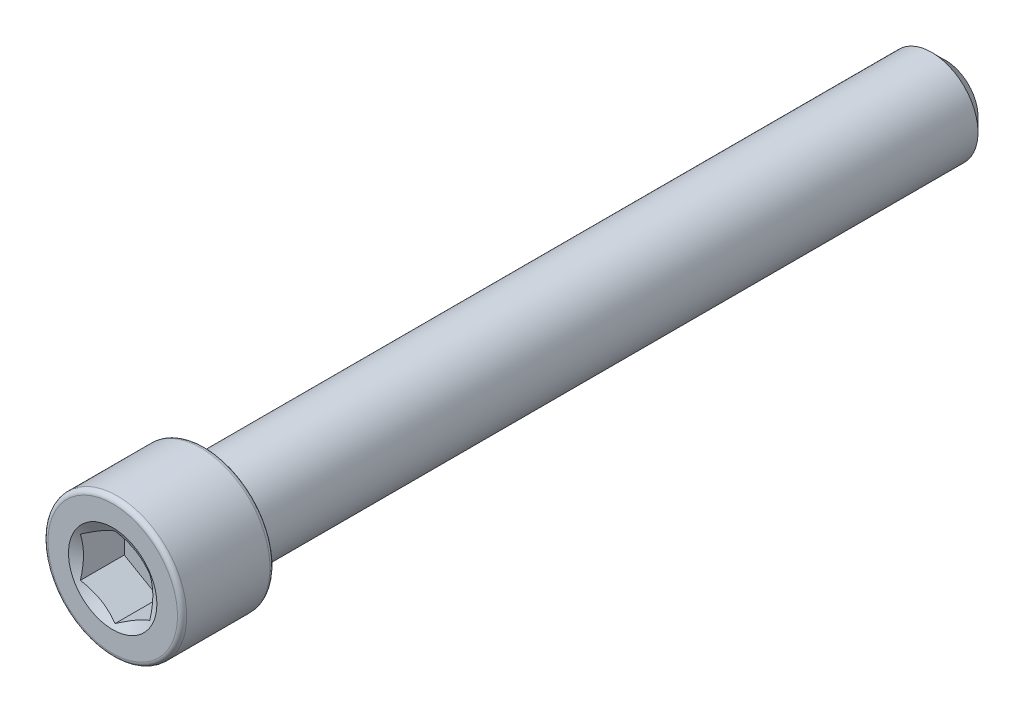
ISO-10303-21;
HEADER;
FILE_DESCRIPTION(('STEP AP214'),'2;1');
FILE_NAME('part.step','',(''),(''),'','','');
FILE_SCHEMA(('AUTOMOTIVE_DESIGN { 1 0 10303 214 1 1 1 1 }'));
ENDSEC;
DATA;
#1=APPLICATION_CONTEXT('core data for automotive mechanical design processes');
#2=APPLICATION_PROTOCOL_DEFINITION('international standard','automotive_design',2000,#1);
#3=PRODUCT_CONTEXT('',#1,'mechanical');
#4=PRODUCT('Part','Part','',(#3));
#5=PRODUCT_RELATED_PRODUCT_CATEGORY('part','',(#4));
#6=PRODUCT_DEFINITION_FORMATION('','',#4);
#7=PRODUCT_DEFINITION_CONTEXT('part definition',#1,'design');
#8=PRODUCT_DEFINITION('design','',#6,#7);
#9=PRODUCT_DEFINITION_SHAPE('','',#8);
#10=(LENGTH_UNIT() NAMED_UNIT(*) SI_UNIT(.MILLI.,.METRE.));
#11=(NAMED_UNIT(*) PLANE_ANGLE_UNIT() SI_UNIT($,.RADIAN.));
#12=(NAMED_UNIT(*) SI_UNIT($,.STERADIAN.) SOLID_ANGLE_UNIT());
#13=UNCERTAINTY_MEASURE_WITH_UNIT(LENGTH_MEASURE(1.E-05),#10,'distance_accuracy_value','');
#14=(GEOMETRIC_REPRESENTATION_CONTEXT(3) GLOBAL_UNCERTAINTY_ASSIGNED_CONTEXT((#13)) GLOBAL_UNIT_ASSIGNED_CONTEXT((#10,
#11,#12)) REPRESENTATION_CONTEXT('',''));
#15=CARTESIAN_POINT('',(0.,0.,0.));
#16=DIRECTION('',(0.,0.,1.));
#17=DIRECTION('',(1.,0.,0.));
#18=AXIS2_PLACEMENT_3D('',#15,#16,#17);
#19=CARTESIAN_POINT('',(0.,0.,-28.575));
#20=DIRECTION('',(0.,0.,-1.));
#21=DIRECTION('',(-1.,0.,0.));
#22=AXIS2_PLACEMENT_3D('',#19,#20,#21);
#23=PLANE('',#22);
#24=CARTESIAN_POINT('',(0.,0.,-28.575));
#25=DIRECTION('',(0.,0.,-1.));
#26=DIRECTION('',(-1.,0.,0.));
#27=AXIS2_PLACEMENT_3D('',#24,#25,#26);
#28=CIRCLE('',#27,2.22250000000003);
#29=CARTESIAN_POINT('',(-2.22250000000003,0.,-28.575));
#30=VERTEX_POINT('',#29);
#31=EDGE_CURVE('E48',#30,#30,#28,.T.);
#32=ORIENTED_EDGE('',*,*,#31,.T.);
#33=EDGE_LOOP('',(#32));
#34=FACE_BOUND('',#33,.T.);
#35=ADVANCED_FACE('F35',(#34),#23,.T.);
#36=CARTESIAN_POINT('',(0.,0.,-28.575));
#37=DIRECTION('',(0.,0.,1.));
#38=DIRECTION('',(1.,0.,0.));
#39=AXIS2_PLACEMENT_3D('',#36,#37,#38);
#40=CONICAL_SURFACE('',#39,2.22250000000003,0.78539816339745);
#41=CARTESIAN_POINT('',(0.,0.,-27.6225));
#42=DIRECTION('',(0.,0.,-1.));
#43=DIRECTION('',(-1.,0.,0.));
#44=AXIS2_PLACEMENT_3D('',#41,#42,#43);
#45=CIRCLE('',#44,3.17500000000002);
#46=CARTESIAN_POINT('',(-3.17500000000002,0.,-27.6225));
#47=VERTEX_POINT('',#46);
#48=EDGE_CURVE('E133',#47,#47,#45,.T.);
#49=ORIENTED_EDGE('',*,*,#48,.T.);
#50=EDGE_LOOP('',(#49));
#51=FACE_BOUND('',#50,.T.);
#52=ORIENTED_EDGE('',*,*,#31,.F.);
#53=EDGE_LOOP('',(#52));
#54=FACE_BOUND('',#53,.T.);
#55=ADVANCED_FACE('F139',(#51,#54),#40,.T.);
#56=CARTESIAN_POINT('',(0.,0.,-28.575));
#57=DIRECTION('',(0.,0.,-1.));
#58=DIRECTION('',(-1.,0.,0.));
#59=AXIS2_PLACEMENT_3D('',#56,#57,#58);
#60=CYLINDRICAL_SURFACE('',#59,3.17500000000002);
#61=CARTESIAN_POINT('',(0.,0.,22.225));
#62=DIRECTION('',(0.,0.,-1.));
#63=DIRECTION('',(-1.,0.,0.));
#64=AXIS2_PLACEMENT_3D('',#61,#62,#63);
#65=CIRCLE('',#64,3.17500000000002);
#66=CARTESIAN_POINT('',(-3.17500000000002,0.,22.225));
#67=VERTEX_POINT('',#66);
#68=EDGE_CURVE('E130',#67,#67,#65,.T.);
#69=ORIENTED_EDGE('',*,*,#68,.T.);
#70=EDGE_LOOP('',(#69));
#71=FACE_BOUND('',#70,.T.);
#72=ORIENTED_EDGE('',*,*,#48,.F.);
#73=EDGE_LOOP('',(#72));
#74=FACE_BOUND('',#73,.T.);
#75=ADVANCED_FACE('F141',(#71,#74),#60,.T.);
#76=CARTESIAN_POINT('',(0.,3.17500000000001,22.225));
#77=DIRECTION('',(0.,0.,-1.));
#78=DIRECTION('',(-1.,0.,0.));
#79=AXIS2_PLACEMENT_3D('',#76,#77,#78);
#80=PLANE('',#79);
#81=CARTESIAN_POINT('',(0.,0.,22.225));
#82=DIRECTION('',(0.,0.,-1.));
#83=DIRECTION('',(-1.,0.,0.));
#84=AXIS2_PLACEMENT_3D('',#81,#82,#83);
#85=CIRCLE('',#84,4.445);
#86=CARTESIAN_POINT('',(-4.445,0.,22.225));
#87=VERTEX_POINT('',#86);
#88=EDGE_CURVE('E127',#87,#87,#85,.T.);
#89=ORIENTED_EDGE('',*,*,#88,.T.);
#90=EDGE_LOOP('',(#89));
#91=FACE_BOUND('',#90,.T.);
#92=ORIENTED_EDGE('',*,*,#68,.F.);
#93=EDGE_LOOP('',(#92));
#94=FACE_BOUND('',#93,.T.);
#95=ADVANCED_FACE('F147',(#91,#94),#80,.T.);
#96=CARTESIAN_POINT('',(0.,0.,22.5425));
#97=DIRECTION('',(0.,0.,-1.));
#98=DIRECTION('',(-1.,0.,0.));
#99=AXIS2_PLACEMENT_3D('',#96,#97,#98);
#100=TOROIDAL_SURFACE('',#99,4.445,0.317499999999999);
#101=CARTESIAN_POINT('',(0.,0.,22.5425));
#102=DIRECTION('',(0.,0.,-1.));
#103=DIRECTION('',(-1.,0.,0.));
#104=AXIS2_PLACEMENT_3D('',#101,#102,#103);
#105=CIRCLE('',#104,4.7625);
#106=CARTESIAN_POINT('',(-4.7625,0.,22.5425));
#107=VERTEX_POINT('',#106);
#108=EDGE_CURVE('E124',#107,#107,#105,.T.);
#109=ORIENTED_EDGE('',*,*,#108,.T.);
#110=EDGE_LOOP('',(#109));
#111=FACE_BOUND('',#110,.T.);
#112=ORIENTED_EDGE('',*,*,#88,.F.);
#113=EDGE_LOOP('',(#112));
#114=FACE_BOUND('',#113,.T.);
#115=ADVANCED_FACE('F153',(#111,#114),#100,.T.);
#116=CARTESIAN_POINT('',(0.,0.,-28.575));
#117=DIRECTION('',(0.,0.,-1.));
#118=DIRECTION('',(-1.,0.,0.));
#119=AXIS2_PLACEMENT_3D('',#116,#117,#118);
#120=CYLINDRICAL_SURFACE('',#119,4.7625);
#121=CARTESIAN_POINT('',(0.,0.,28.2575));
#122=DIRECTION('',(0.,0.,-1.));
#123=DIRECTION('',(-1.,0.,0.));
#124=AXIS2_PLACEMENT_3D('',#121,#122,#123);
#125=CIRCLE('',#124,4.7625);
#126=CARTESIAN_POINT('',(-4.7625,0.,28.2575));
#127=VERTEX_POINT('',#126);
#128=EDGE_CURVE('E121',#127,#127,#125,.T.);
#129=ORIENTED_EDGE('',*,*,#128,.T.);
#130=EDGE_LOOP('',(#129));
#131=FACE_BOUND('',#130,.T.);
#132=ORIENTED_EDGE('',*,*,#108,.F.);
#133=EDGE_LOOP('',(#132));
#134=FACE_BOUND('',#133,.T.);
#135=ADVANCED_FACE('F157',(#131,#134),#120,.T.);
#136=CARTESIAN_POINT('',(0.,0.,28.2575));
#137=DIRECTION('',(0.,0.,-1.));
#138=DIRECTION('',(-1.,0.,0.));
#139=AXIS2_PLACEMENT_3D('',#136,#137,#138);
#140=TOROIDAL_SURFACE('',#139,4.445,0.317499999999999);
#141=CARTESIAN_POINT('',(0.,0.,28.575));
#142=DIRECTION('',(0.,0.,-1.));
#143=DIRECTION('',(-1.,0.,0.));
#144=AXIS2_PLACEMENT_3D('',#141,#142,#143);
#145=CIRCLE('',#144,4.445);
#146=CARTESIAN_POINT('',(-4.445,0.,28.575));
#147=VERTEX_POINT('',#146);
#148=EDGE_CURVE('E118',#147,#147,#145,.T.);
#149=ORIENTED_EDGE('',*,*,#148,.T.);
#150=EDGE_LOOP('',(#149));
#151=FACE_BOUND('',#150,.T.);
#152=ORIENTED_EDGE('',*,*,#128,.F.);
#153=EDGE_LOOP('',(#152));
#154=FACE_BOUND('',#153,.T.);
#155=ADVANCED_FACE('F161',(#151,#154),#140,.T.);
#156=CARTESIAN_POINT('',(0.,4.44499999999999,28.575));
#157=DIRECTION('',(0.,0.,1.));
#158=DIRECTION('',(1.,0.,0.));
#159=AXIS2_PLACEMENT_3D('',#156,#157,#158);
#160=PLANE('',#159);
#161=CARTESIAN_POINT('',(0.,0.,28.575));
#162=DIRECTION('',(0.,0.,1.));
#163=DIRECTION('',(1.,0.,0.));
#164=AXIS2_PLACEMENT_3D('',#161,#162,#163);
#165=CIRCLE('',#164,3.03219221417965);
#166=CARTESIAN_POINT('',(3.03219221417965,0.,28.575));
#167=VERTEX_POINT('',#166);
#168=EDGE_CURVE('E255',#167,#167,#165,.T.);
#169=ORIENTED_EDGE('',*,*,#168,.F.);
#170=EDGE_LOOP('',(#169));
#171=FACE_BOUND('',#170,.T.);
#172=ORIENTED_EDGE('',*,*,#148,.F.);
#173=EDGE_LOOP('',(#172));
#174=FACE_BOUND('',#173,.T.);
#175=ADVANCED_FACE('F165',(#171,#174),#160,.T.);
#176=CARTESIAN_POINT('',(0.,0.,28.575));
#177=DIRECTION('',(0.,0.,1.));
#178=DIRECTION('',(1.,0.,0.));
#179=AXIS2_PLACEMENT_3D('',#176,#177,#178);
#180=CONICAL_SURFACE('',#179,3.03219221417965,1.0471975511966);
#181=ORIENTED_EDGE('',*,*,#168,.T.);
#182=EDGE_LOOP('',(#181));
#183=FACE_BOUND('',#182,.T.);
#184=CARTESIAN_POINT('',(2.38144999999999,1.37469985845395,28.4119296797746));
#185=CARTESIAN_POINT('',(2.27680510857801,1.43511661468575,28.3770335875339));
#186=CARTESIAN_POINT('',(2.17125693139549,1.49605488319455,28.3452965816836));
#187=CARTESIAN_POINT('',(1.95833280582788,1.61898668440798,28.2898986717318));
#188=CARTESIAN_POINT('',(1.85095307338657,1.68098240183847,28.2662573664923));
#189=CARTESIAN_POINT('',(1.63752441306378,1.80420549632862,28.2294553443056));
#190=CARTESIAN_POINT('',(1.53150832846242,1.86541391131164,28.2160497054727));
#191=CARTESIAN_POINT('',(1.31897718209788,1.98811882587639,28.2000446234132));
#192=CARTESIAN_POINT('',(1.21246289310218,2.0496148793006,28.1974319282234));
#193=CARTESIAN_POINT('',(1.01342600969027,2.16452887751713,28.2028600893658));
#194=CARTESIAN_POINT('',(0.920873657438131,2.21796400300404,28.2095681458576));
#195=CARTESIAN_POINT('',(0.736371946153149,2.32448611568037,28.2308309696216));
#196=CARTESIAN_POINT('',(0.644423225529249,2.37757273428422,28.2453930040322));
#197=CARTESIAN_POINT('',(0.459540942889931,2.48431456993442,28.2817978377252));
#198=CARTESIAN_POINT('',(0.366630787034617,2.53795627342794,28.3037949938814));
#199=CARTESIAN_POINT('',(0.182196405744558,2.64443951311357,28.3537202236105));
#200=CARTESIAN_POINT('',(0.0906698164537914,2.69728241407861,28.3816365624169));
#201=CARTESIAN_POINT('',(-0.000200000000002797,2.74974612706942,28.4119296797746));
#202=B_SPLINE_CURVE_WITH_KNOTS('',3,(#184,#185,#186,#187,#188,#189,#190,#191,#192,#193,#194,
#195,#196,#197,#198,#199,#200,#201),.UNSPECIFIED.,.F.,.F.,(4,2,2,2,2,2,2,2,4),(0.,
0.377463001720441,0.755833447356085,1.1248388545394,1.49339104874266,1.81432726847353,
2.13556095518869,2.4639212191382,2.791636496483),.UNSPECIFIED.);
#203=CARTESIAN_POINT('',(2.38124999999999,1.37481532850779,28.4118630089087));
#204=VERTEX_POINT('',#203);
#205=CARTESIAN_POINT('',(0.,2.74963065701558,28.4118630089087));
#206=VERTEX_POINT('',#205);
#207=EDGE_CURVE('E102',#204,#206,#202,.T.);
#208=ORIENTED_EDGE('',*,*,#207,.F.);
#209=CARTESIAN_POINT('',(2.38124999999999,-3.59976633824536,29.3162611644295));
#210=CARTESIAN_POINT('',(2.38124999999999,-3.49646395881335,29.2665324836855));
#211=CARTESIAN_POINT('',(2.38124999999999,-3.39291407009264,29.2173085892494));
#212=CARTESIAN_POINT('',(2.38124999999999,-3.18518717181845,29.1201564977165));
#213=CARTESIAN_POINT('',(2.38124999999999,-3.08101005703531,29.0722285258865));
#214=CARTESIAN_POINT('',(2.38124999999999,-2.87131401421191,28.9776930902144));
#215=CARTESIAN_POINT('',(2.38124999999999,-2.76579079437245,28.9310951113206));
#216=CARTESIAN_POINT('',(2.38124999999999,-2.55387118203946,28.8399364827971));
#217=CARTESIAN_POINT('',(2.38124999999999,-2.44747483422771,28.7953757296712));
#218=CARTESIAN_POINT('',(2.38124999999999,-2.23067196845909,28.707631851781));
#219=CARTESIAN_POINT('',(2.38124999999999,-2.12023600195454,28.6645210708126));
#220=CARTESIAN_POINT('',(2.38124999999999,-1.89803839134692,28.5817937390092));
#221=CARTESIAN_POINT('',(2.38124999999999,-1.78627659559216,28.5421775923576));
#222=CARTESIAN_POINT('',(2.38124999999999,-1.56149041735538,28.4675477895721));
#223=CARTESIAN_POINT('',(2.38124999999999,-1.44846944761671,28.4325239630361));
#224=CARTESIAN_POINT('',(2.38124999999999,-1.22081073511454,28.3682629117452));
#225=CARTESIAN_POINT('',(2.38124999999999,-1.10617354309387,28.3390237645329));
#226=CARTESIAN_POINT('',(2.38124999999999,-0.875790756878792,28.2879337388859));
#227=CARTESIAN_POINT('',(2.38124999999999,-0.760052762621303,28.2660492449066));
#228=CARTESIAN_POINT('',(2.38124999999999,-0.527241538813737,28.2309822843521));
#229=CARTESIAN_POINT('',(2.38124999999999,-0.410168413785966,28.2177991412743));
#230=CARTESIAN_POINT('',(2.38124999999999,-0.176757909156527,28.2013592365983));
#231=CARTESIAN_POINT('',(2.38124999999999,-0.0604292020566079,28.1979823294229));
#232=CARTESIAN_POINT('',(2.38124999999999,0.172102526495439,28.201130157101));
#233=CARTESIAN_POINT('',(2.38124999999999,0.288305540624632,28.2076554407246));
#234=CARTESIAN_POINT('',(2.38124999999999,0.488407104907263,28.2269728989663));
#235=CARTESIAN_POINT('',(2.38124999999999,0.572526768128159,28.2375877365416));
#236=CARTESIAN_POINT('',(2.38124999999999,0.740085928751661,28.2632929254538));
#237=CARTESIAN_POINT('',(2.38124999999999,0.823525319662301,28.2783839641938));
#238=CARTESIAN_POINT('',(2.38124999999999,1.07273325586548,28.32957343129));
#239=CARTESIAN_POINT('',(2.38124999999999,1.23729002677746,28.3715771837148));
#240=CARTESIAN_POINT('',(2.38124999999999,1.56668315583935,28.4679511253518));
#241=CARTESIAN_POINT('',(2.38124999999999,1.7314405282236,28.5225811694067));
#242=CARTESIAN_POINT('',(2.38124999999999,1.97631292230749,28.6106187750601));
#243=CARTESIAN_POINT('',(2.38124999999999,2.05754928439702,28.6409756920629));
#244=CARTESIAN_POINT('',(2.38124999999999,2.21936297141559,28.7033957224258));
#245=CARTESIAN_POINT('',(2.38124999999999,2.29994030817706,28.7354588050747));
#246=CARTESIAN_POINT('',(2.38124999999999,2.5091120281204,28.8208324530248));
#247=CARTESIAN_POINT('',(2.38124999999999,2.63725060996072,28.87525731756));
#248=CARTESIAN_POINT('',(2.38124999999999,2.89233256605393,28.9868480388214));
#249=CARTESIAN_POINT('',(2.38124999999999,3.0192758431584,29.0440141160782));
#250=CARTESIAN_POINT('',(2.38124999999999,3.27222855247939,29.1604567661809));
#251=CARTESIAN_POINT('',(2.38124999999999,3.39823772867163,29.2197338935472));
#252=CARTESIAN_POINT('',(2.38124999999999,3.64947609912466,29.3399213116136));
#253=CARTESIAN_POINT('',(2.38124999999999,3.77470527471068,29.400831641232));
#254=CARTESIAN_POINT('',(2.38124999999999,4.14976436460612,29.5856293734581));
#255=CARTESIAN_POINT('',(2.38124999999999,4.39864815512714,29.7114349728279));
#256=CARTESIAN_POINT('',(2.38124999999999,4.89467625611778,29.9663121050035));
#257=CARTESIAN_POINT('',(2.38124999999999,5.14182083564056,30.0953831177985));
#258=CARTESIAN_POINT('',(2.38124999999999,5.61084172457359,30.343066970761));
#259=CARTESIAN_POINT('',(2.38124999999999,5.83282885020019,30.4614703062649));
#260=CARTESIAN_POINT('',(2.38124999999999,6.27608857926104,30.6996296719868));
#261=CARTESIAN_POINT('',(2.38124999999999,6.49736114870038,30.8193857653776));
#262=CARTESIAN_POINT('',(2.38124999999999,6.93875603869058,31.0595822776972));
#263=CARTESIAN_POINT('',(2.38124999999999,7.15887985119655,31.1800199580106));
#264=CARTESIAN_POINT('',(2.38124999999999,7.59868091402183,31.421675883145));
#265=CARTESIAN_POINT('',(2.38124999999999,7.81835819130603,31.5428940788725));
#266=CARTESIAN_POINT('',(2.38124999999999,8.03787642276088,31.6643977522439));
#267=B_SPLINE_CURVE_WITH_KNOTS('',3,(#209,#210,#211,#212,#213,#214,#215,#216,#217,#218,#219,
#220,#221,#222,#223,#224,#225,#226,#227,#228,#229,#230,#231,#232,#233,#234,#235,#236,#237,#238,
#239,#240,#241,#242,#243,#244,#245,#246,#247,#248,#249,#250,#251,#252,#253,#254,#255,#256,#257,
#258,#259,#260,#261,#262,#263,#264,#265,#266),.UNSPECIFIED.,.F.,.F.,(4,2,2,2,2,2,2,2,2,2,2,2,2,
2,2,2,2,2,2,2,2,2,2,2,2,2,2,2,4),(0.,0.343950780921491,0.687960970461107,1.0340054839437,
1.38003239789182,1.73564357991987,2.09129583755095,2.44614664320016,2.80087932031081,
3.15396785782398,3.50702894058493,3.8557456967058,4.20448177908074,4.45871798756717,
4.71299325892999,5.22184880640699,5.74229337432344,6.00244751925213,6.26259698295639,
6.68020411231571,7.09784489471858,7.51559620207539,7.93335747307521,8.76993188334094,
9.60637389902891,10.3611381643167,11.1159378234817,11.8686893766333,12.6213940361871),.UNSPECIFIED.);
#268=CARTESIAN_POINT('',(2.38124999999999,-1.37481532850779,28.4118630089087));
#269=VERTEX_POINT('',#268);
#270=EDGE_CURVE('E211',#269,#204,#267,.T.);
#271=ORIENTED_EDGE('',*,*,#270,.F.);
#272=CARTESIAN_POINT('',(-0.000200000000000813,-2.74974612706942,28.4119296797746));
#273=CARTESIAN_POINT('',(0.104444891421975,-2.68932937083762,28.3770335875339));
#274=CARTESIAN_POINT('',(0.209993068604494,-2.62839110232882,28.3452965816836));
#275=CARTESIAN_POINT('',(0.422917194172109,-2.50545930111539,28.2898986717318));
#276=CARTESIAN_POINT('',(0.530296926613417,-2.44346358368489,28.2662573664923));
#277=CARTESIAN_POINT('',(0.743725586936211,-2.32024048919474,28.2294553443056));
#278=CARTESIAN_POINT('',(0.849741671537564,-2.25903207421172,28.2160497054727));
#279=CARTESIAN_POINT('',(1.06227281790211,-2.13632715964697,28.2000446234132));
#280=CARTESIAN_POINT('',(1.16878710689781,-2.07483110622276,28.1974319282234));
#281=CARTESIAN_POINT('',(1.36782399030972,-1.95991710800623,28.2028600893658));
#282=CARTESIAN_POINT('',(1.46037634256186,-1.90648198251933,28.2095681458576));
#283=CARTESIAN_POINT('',(1.64487805384684,-1.799959869843,28.2308309696216));
#284=CARTESIAN_POINT('',(1.73682677447074,-1.74687325123915,28.2453930040322));
#285=CARTESIAN_POINT('',(1.92170905711005,-1.64013141558895,28.2817978377252));
#286=CARTESIAN_POINT('',(2.01461921296537,-1.58648971209543,28.3037949938814));
#287=CARTESIAN_POINT('',(2.19905359425543,-1.48000647240979,28.3537202236105));
#288=CARTESIAN_POINT('',(2.29058018354619,-1.42716357144476,28.3816365624169));
#289=CARTESIAN_POINT('',(2.38144999999999,-1.37469985845395,28.4119296797746));
#290=B_SPLINE_CURVE_WITH_KNOTS('',3,(#272,#273,#274,#275,#276,#277,#278,#279,#280,#281,#282,
#283,#284,#285,#286,#287,#288,#289),.UNSPECIFIED.,.F.,.F.,(4,2,2,2,2,2,2,2,4),(0.,
0.377463001720439,0.755833447356085,1.1248388545394,1.49339104874266,1.81432726847353,
2.13556095518869,2.46392121913819,2.791636496483),.UNSPECIFIED.);
#291=CARTESIAN_POINT('',(0.,-2.74963065701558,28.4118630089087));
#292=VERTEX_POINT('',#291);
#293=EDGE_CURVE('E205',#292,#269,#290,.T.);
#294=ORIENTED_EDGE('',*,*,#293,.F.);
#295=CARTESIAN_POINT('',(-2.38144999999999,-1.37469985845395,28.4119296797746));
#296=CARTESIAN_POINT('',(-2.27680510857801,-1.43511661468575,28.3770335875339));
#297=CARTESIAN_POINT('',(-2.17125693139549,-1.49605488319455,28.3452965816836));
#298=CARTESIAN_POINT('',(-1.95833280582788,-1.61898668440798,28.2898986717318));
#299=CARTESIAN_POINT('',(-1.85095307338657,-1.68098240183848,28.2662573664923));
#300=CARTESIAN_POINT('',(-1.63752441306378,-1.80420549632862,28.2294553443056));
#301=CARTESIAN_POINT('',(-1.53150832846242,-1.86541391131165,28.2160497054727));
#302=CARTESIAN_POINT('',(-1.31897718209788,-1.9881188258764,28.2000446234132));
#303=CARTESIAN_POINT('',(-1.21246289310218,-2.04961487930061,28.1974319282234));
#304=CARTESIAN_POINT('',(-1.01342600969027,-2.16452887751713,28.2028600893658));
#305=CARTESIAN_POINT('',(-0.920873657438133,-2.21796400300404,28.2095681458576));
#306=CARTESIAN_POINT('',(-0.736371946153151,-2.32448611568037,28.2308309696216));
#307=CARTESIAN_POINT('',(-0.644423225529251,-2.37757273428422,28.2453930040322));
#308=CARTESIAN_POINT('',(-0.459540942889935,-2.48431456993442,28.2817978377252));
#309=CARTESIAN_POINT('',(-0.366630787034621,-2.53795627342794,28.3037949938814));
#310=CARTESIAN_POINT('',(-0.182196405744562,-2.64443951311357,28.3537202236105));
#311=CARTESIAN_POINT('',(-0.0906698164537959,-2.69728241407861,28.3816365624169));
#312=CARTESIAN_POINT('',(0.000199999999998754,-2.74974612706942,28.4119296797746));
#313=B_SPLINE_CURVE_WITH_KNOTS('',3,(#295,#296,#297,#298,#299,#300,#301,#302,#303,#304,#305,
#306,#307,#308,#309,#310,#311,#312),.UNSPECIFIED.,.F.,.F.,(4,2,2,2,2,2,2,2,4),(0.,
0.37746300172044,0.755833447356084,1.1248388545394,1.49339104874266,1.81432726847353,
2.13556095518869,2.46392121913819,2.79163649648299),.UNSPECIFIED.);
#314=CARTESIAN_POINT('',(-2.38124999999999,-1.37481532850779,28.4118630089087));
#315=VERTEX_POINT('',#314);
#316=EDGE_CURVE('E55',#315,#292,#313,.T.);
#317=ORIENTED_EDGE('',*,*,#316,.F.);
#318=CARTESIAN_POINT('',(-2.38124999999999,-3.59976633824536,29.3162611644295));
#319=CARTESIAN_POINT('',(-2.38124999999999,-3.49646395881335,29.2665324836855));
#320=CARTESIAN_POINT('',(-2.38124999999999,-3.39291407009264,29.2173085892494));
#321=CARTESIAN_POINT('',(-2.38124999999999,-3.18518717181845,29.1201564977165));
#322=CARTESIAN_POINT('',(-2.38124999999999,-3.08101005703531,29.0722285258865));
#323=CARTESIAN_POINT('',(-2.38124999999999,-2.87131401421191,28.9776930902144));
#324=CARTESIAN_POINT('',(-2.38124999999999,-2.76579079437245,28.9310951113206));
#325=CARTESIAN_POINT('',(-2.38124999999999,-2.55387118203946,28.8399364827971));
#326=CARTESIAN_POINT('',(-2.38124999999999,-2.44747483422771,28.7953757296712));
#327=CARTESIAN_POINT('',(-2.38124999999999,-2.23067196845909,28.707631851781));
#328=CARTESIAN_POINT('',(-2.38124999999999,-2.12023600195453,28.6645210708126));
#329=CARTESIAN_POINT('',(-2.38124999999999,-1.89803839134692,28.5817937390092));
#330=CARTESIAN_POINT('',(-2.38124999999999,-1.78627659559216,28.5421775923576));
#331=CARTESIAN_POINT('',(-2.38124999999999,-1.56149041735538,28.4675477895721));
#332=CARTESIAN_POINT('',(-2.38124999999999,-1.44846944761671,28.4325239630361));
#333=CARTESIAN_POINT('',(-2.38124999999999,-1.22081073511454,28.3682629117452));
#334=CARTESIAN_POINT('',(-2.38124999999999,-1.10617354309387,28.3390237645329));
#335=CARTESIAN_POINT('',(-2.38124999999999,-0.875790756878793,28.2879337388859));
#336=CARTESIAN_POINT('',(-2.38124999999999,-0.760052762621304,28.2660492449066));
#337=CARTESIAN_POINT('',(-2.38124999999999,-0.527241538813738,28.2309822843521));
#338=CARTESIAN_POINT('',(-2.38124999999999,-0.410168413785967,28.2177991412743));
#339=CARTESIAN_POINT('',(-2.38124999999999,-0.176757909156528,28.2013592365983));
#340=CARTESIAN_POINT('',(-2.38124999999999,-0.0604292020566089,28.1979823294229));
#341=CARTESIAN_POINT('',(-2.38124999999999,0.172102526495438,28.2011301571011));
#342=CARTESIAN_POINT('',(-2.38124999999999,0.288305540624632,28.2076554407246));
#343=CARTESIAN_POINT('',(-2.38124999999999,0.488407104907262,28.2269728989663));
#344=CARTESIAN_POINT('',(-2.38124999999999,0.572526768128158,28.2375877365416));
#345=CARTESIAN_POINT('',(-2.38124999999999,0.74008592875166,28.2632929254538));
#346=CARTESIAN_POINT('',(-2.38124999999999,0.823525319662301,28.2783839641938));
#347=CARTESIAN_POINT('',(-2.38124999999999,1.07273325586548,28.32957343129));
#348=CARTESIAN_POINT('',(-2.38124999999999,1.23729002677746,28.3715771837148));
#349=CARTESIAN_POINT('',(-2.38124999999999,1.56668315583936,28.4679511253518));
#350=CARTESIAN_POINT('',(-2.38124999999999,1.7314405282236,28.5225811694067));
#351=CARTESIAN_POINT('',(-2.38124999999999,1.97631292230749,28.6106187750601));
#352=CARTESIAN_POINT('',(-2.38124999999999,2.05754928439702,28.6409756920629));
#353=CARTESIAN_POINT('',(-2.38124999999999,2.21936297141559,28.7033957224258));
#354=CARTESIAN_POINT('',(-2.38124999999999,2.29994030817706,28.7354588050747));
#355=CARTESIAN_POINT('',(-2.38124999999999,2.5091120281204,28.8208324530248));
#356=CARTESIAN_POINT('',(-2.38124999999999,2.63725060996072,28.87525731756));
#357=CARTESIAN_POINT('',(-2.38124999999999,2.89233256605393,28.9868480388214));
#358=CARTESIAN_POINT('',(-2.38124999999999,3.01927584315839,29.0440141160782));
#359=CARTESIAN_POINT('',(-2.38124999999999,3.27222855247939,29.1604567661809));
#360=CARTESIAN_POINT('',(-2.38124999999999,3.39823772867163,29.2197338935472));
#361=CARTESIAN_POINT('',(-2.38124999999999,3.64947609912465,29.3399213116136));
#362=CARTESIAN_POINT('',(-2.38124999999999,3.77470527471068,29.400831641232));
#363=CARTESIAN_POINT('',(-2.38124999999999,4.14976436460612,29.5856293734581));
#364=CARTESIAN_POINT('',(-2.38124999999999,4.39864815512714,29.7114349728279));
#365=CARTESIAN_POINT('',(-2.38124999999999,4.89467625611778,29.9663121050035));
#366=CARTESIAN_POINT('',(-2.38124999999999,5.14182083564055,30.0953831177985));
#367=CARTESIAN_POINT('',(-2.38124999999999,5.61084172457359,30.343066970761));
#368=CARTESIAN_POINT('',(-2.38124999999999,5.83282885020018,30.4614703062649));
#369=CARTESIAN_POINT('',(-2.38124999999999,6.27608857926104,30.6996296719868));
#370=CARTESIAN_POINT('',(-2.38124999999999,6.49736114870038,30.8193857653776));
#371=CARTESIAN_POINT('',(-2.38124999999999,6.93875603869058,31.0595822776972));
#372=CARTESIAN_POINT('',(-2.38124999999999,7.15887985119655,31.1800199580106));
#373=CARTESIAN_POINT('',(-2.38124999999999,7.59868091402184,31.421675883145));
#374=CARTESIAN_POINT('',(-2.38124999999999,7.81835819130603,31.5428940788725));
#375=CARTESIAN_POINT('',(-2.38124999999999,8.03787642276088,31.6643977522439));
#376=B_SPLINE_CURVE_WITH_KNOTS('',3,(#318,#319,#320,#321,#322,#323,#324,#325,#326,#327,#328,
#329,#330,#331,#332,#333,#334,#335,#336,#337,#338,#339,#340,#341,#342,#343,#344,#345,#346,#347,
#348,#349,#350,#351,#352,#353,#354,#355,#356,#357,#358,#359,#360,#361,#362,#363,#364,#365,#366,
#367,#368,#369,#370,#371,#372,#373,#374,#375),.UNSPECIFIED.,.F.,.F.,(4,2,2,2,2,2,2,2,2,2,2,2,2,
2,2,2,2,2,2,2,2,2,2,2,2,2,2,2,4),(0.,0.343950780921491,0.687960970461107,1.0340054839437,
1.38003239789182,1.73564357991987,2.09129583755095,2.44614664320016,2.80087932031081,
3.15396785782398,3.50702894058493,3.8557456967058,4.20448177908074,4.45871798756717,
4.71299325892998,5.22184880640699,5.74229337432344,6.00244751925213,6.26259698295639,
6.68020411231571,7.09784489471858,7.51559620207538,7.93335747307521,8.76993188334094,
9.60637389902891,10.3611381643167,11.1159378234817,11.8686893766333,12.6213940361872),.UNSPECIFIED.);
#377=CARTESIAN_POINT('',(-2.38124999999999,1.37481532850779,28.4118630089087));
#378=VERTEX_POINT('',#377);
#379=EDGE_CURVE('E11',#378,#315,#376,.F.);
#380=ORIENTED_EDGE('',*,*,#379,.F.);
#381=CARTESIAN_POINT('',(0.000199999999997738,2.74974612706942,28.4119296797746));
#382=CARTESIAN_POINT('',(-0.104444891421978,2.68932937083762,28.3770335875339));
#383=CARTESIAN_POINT('',(-0.209993068604498,2.62839110232882,28.3452965816836));
#384=CARTESIAN_POINT('',(-0.422917194172112,2.50545930111539,28.2898986717318));
#385=CARTESIAN_POINT('',(-0.53029692661342,2.44346358368489,28.2662573664923));
#386=CARTESIAN_POINT('',(-0.743725586936214,2.32024048919474,28.2294553443056));
#387=CARTESIAN_POINT('',(-0.849741671537567,2.25903207421172,28.2160497054727));
#388=CARTESIAN_POINT('',(-1.06227281790212,2.13632715964697,28.2000446234132));
#389=CARTESIAN_POINT('',(-1.16878710689781,2.07483110622276,28.1974319282234));
#390=CARTESIAN_POINT('',(-1.36782399030972,1.95991710800623,28.2028600893658));
#391=CARTESIAN_POINT('',(-1.46037634256186,1.90648198251933,28.2095681458576));
#392=CARTESIAN_POINT('',(-1.64487805384684,1.799959869843,28.2308309696216));
#393=CARTESIAN_POINT('',(-1.73682677447074,1.74687325123915,28.2453930040322));
#394=CARTESIAN_POINT('',(-1.92170905711006,1.64013141558895,28.2817978377252));
#395=CARTESIAN_POINT('',(-2.01461921296537,1.58648971209543,28.3037949938814));
#396=CARTESIAN_POINT('',(-2.19905359425543,1.48000647240979,28.3537202236105));
#397=CARTESIAN_POINT('',(-2.29058018354619,1.42716357144476,28.3816365624169));
#398=CARTESIAN_POINT('',(-2.38144999999999,1.37469985845395,28.4119296797746));
#399=B_SPLINE_CURVE_WITH_KNOTS('',3,(#381,#382,#383,#384,#385,#386,#387,#388,#389,#390,#391,
#392,#393,#394,#395,#396,#397,#398),.UNSPECIFIED.,.F.,.F.,(4,2,2,2,2,2,2,2,4),(0.,
0.37746300172044,0.755833447356086,1.1248388545394,1.49339104874266,1.81432726847353,
2.13556095518869,2.46392121913819,2.79163649648299),.UNSPECIFIED.);
#400=EDGE_CURVE('E93',#206,#378,#399,.T.);
#401=ORIENTED_EDGE('',*,*,#400,.F.);
#402=EDGE_LOOP('',(#208,#271,#294,#317,#380,#401));
#403=FACE_BOUND('',#402,.T.);
#404=ADVANCED_FACE('F92',(#183,#403),#180,.F.);
#405=CARTESIAN_POINT('',(0.,0.,25.4));
#406=DIRECTION('',(0.,0.,1.));
#407=DIRECTION('',(1.,0.,0.));
#408=AXIS2_PLACEMENT_3D('',#405,#406,#407);
#409=PLANE('',#408);
#410=DIRECTION('',(-0.866025403784438,-0.5,0.));
#411=VECTOR('',#410,1.);
#412=CARTESIAN_POINT('',(0.,2.74963065701558,25.4));
#413=LINE('',#412,#411);
#414=CARTESIAN_POINT('',(0.,2.74963065701558,25.4));
#415=VERTEX_POINT('',#414);
#416=CARTESIAN_POINT('',(-2.38124999999999,1.37481532850779,25.4));
#417=VERTEX_POINT('',#416);
#418=EDGE_CURVE('E101',#415,#417,#413,.T.);
#419=ORIENTED_EDGE('',*,*,#418,.T.);
#420=DIRECTION('',(0.,-1.,0.));
#421=VECTOR('',#420,1.);
#422=CARTESIAN_POINT('',(-2.38124999999999,1.37481532850779,25.4));
#423=LINE('',#422,#421);
#424=CARTESIAN_POINT('',(-2.38124999999999,-1.37481532850779,25.4));
#425=VERTEX_POINT('',#424);
#426=EDGE_CURVE('E106',#417,#425,#423,.T.);
#427=ORIENTED_EDGE('',*,*,#426,.T.);
#428=DIRECTION('',(0.866025403784439,-0.5,0.));
#429=VECTOR('',#428,1.);
#430=CARTESIAN_POINT('',(-2.38124999999999,-1.37481532850779,25.4));
#431=LINE('',#430,#429);
#432=CARTESIAN_POINT('',(0.,-2.74963065701558,25.4));
#433=VERTEX_POINT('',#432);
#434=EDGE_CURVE('E237',#425,#433,#431,.T.);
#435=ORIENTED_EDGE('',*,*,#434,.T.);
#436=DIRECTION('',(0.866025403784439,0.5,0.));
#437=VECTOR('',#436,1.);
#438=CARTESIAN_POINT('',(0.,-2.74963065701558,25.4));
#439=LINE('',#438,#437);
#440=CARTESIAN_POINT('',(2.38124999999999,-1.37481532850779,25.4));
#441=VERTEX_POINT('',#440);
#442=EDGE_CURVE('E241',#433,#441,#439,.T.);
#443=ORIENTED_EDGE('',*,*,#442,.T.);
#444=DIRECTION('',(0.,1.,0.));
#445=VECTOR('',#444,1.);
#446=CARTESIAN_POINT('',(2.38124999999999,-1.37481532850779,25.4));
#447=LINE('',#446,#445);
#448=CARTESIAN_POINT('',(2.38124999999999,1.37481532850779,25.4));
#449=VERTEX_POINT('',#448);
#450=EDGE_CURVE('E114',#441,#449,#447,.T.);
#451=ORIENTED_EDGE('',*,*,#450,.T.);
#452=DIRECTION('',(-0.866025403784439,0.5,0.));
#453=VECTOR('',#452,1.);
#454=CARTESIAN_POINT('',(2.38124999999999,1.37481532850779,25.4));
#455=LINE('',#454,#453);
#456=EDGE_CURVE('E109',#449,#415,#455,.T.);
#457=ORIENTED_EDGE('',*,*,#456,.T.);
#458=EDGE_LOOP('',(#419,#427,#435,#443,#451,#457));
#459=FACE_BOUND('',#458,.T.);
#460=ADVANCED_FACE('F191',(#459),#409,.T.);
#461=CARTESIAN_POINT('',(-2.38124999999999,1.37481532850779,25.4));
#462=DIRECTION('',(-1.,0.,0.));
#463=DIRECTION('',(0.,-1.,0.));
#464=AXIS2_PLACEMENT_3D('',#461,#462,#463);
#465=PLANE('',#464);
#466=DIRECTION('',(0.,0.,1.));
#467=VECTOR('',#466,1.);
#468=CARTESIAN_POINT('',(-2.38124999999999,1.37481532850779,25.4));
#469=LINE('',#468,#467);
#470=EDGE_CURVE('E99',#417,#378,#469,.T.);
#471=ORIENTED_EDGE('',*,*,#470,.T.);
#472=ORIENTED_EDGE('',*,*,#379,.T.);
#473=DIRECTION('',(0.,0.,1.));
#474=VECTOR('',#473,1.);
#475=CARTESIAN_POINT('',(-2.38124999999999,-1.37481532850779,25.4));
#476=LINE('',#475,#474);
#477=EDGE_CURVE('E108',#425,#315,#476,.T.);
#478=ORIENTED_EDGE('',*,*,#477,.F.);
#479=ORIENTED_EDGE('',*,*,#426,.F.);
#480=EDGE_LOOP('',(#471,#472,#478,#479));
#481=FACE_BOUND('',#480,.T.);
#482=ADVANCED_FACE('F104',(#481),#465,.F.);
#483=CARTESIAN_POINT('',(-2.38124999999999,-1.37481532850779,25.4));
#484=DIRECTION('',(-0.5,-0.866025403784439,0.));
#485=DIRECTION('',(0.866025403784439,-0.5,0.));
#486=AXIS2_PLACEMENT_3D('',#483,#484,#485);
#487=PLANE('',#486);
#488=ORIENTED_EDGE('',*,*,#477,.T.);
#489=ORIENTED_EDGE('',*,*,#316,.T.);
#490=DIRECTION('',(0.,0.,1.));
#491=VECTOR('',#490,1.);
#492=CARTESIAN_POINT('',(0.,-2.74963065701558,25.4));
#493=LINE('',#492,#491);
#494=EDGE_CURVE('E111',#433,#292,#493,.T.);
#495=ORIENTED_EDGE('',*,*,#494,.F.);
#496=ORIENTED_EDGE('',*,*,#434,.F.);
#497=EDGE_LOOP('',(#488,#489,#495,#496));
#498=FACE_BOUND('',#497,.T.);
#499=ADVANCED_FACE('F226',(#498),#487,.F.);
#500=CARTESIAN_POINT('',(0.,-2.74963065701558,25.4));
#501=DIRECTION('',(0.5,-0.866025403784439,0.));
#502=DIRECTION('',(0.866025403784439,0.5,0.));
#503=AXIS2_PLACEMENT_3D('',#500,#501,#502);
#504=PLANE('',#503);
#505=ORIENTED_EDGE('',*,*,#494,.T.);
#506=ORIENTED_EDGE('',*,*,#293,.T.);
#507=DIRECTION('',(0.,0.,1.));
#508=VECTOR('',#507,1.);
#509=CARTESIAN_POINT('',(2.38124999999999,-1.37481532850779,25.4));
#510=LINE('',#509,#508);
#511=EDGE_CURVE('E251',#441,#269,#510,.T.);
#512=ORIENTED_EDGE('',*,*,#511,.F.);
#513=ORIENTED_EDGE('',*,*,#442,.F.);
#514=EDGE_LOOP('',(#505,#506,#512,#513));
#515=FACE_BOUND('',#514,.T.);
#516=ADVANCED_FACE('F221',(#515),#504,.F.);
#517=CARTESIAN_POINT('',(2.38124999999999,-1.37481532850779,25.4));
#518=DIRECTION('',(1.,0.,0.));
#519=DIRECTION('',(0.,0.,-1.));
#520=AXIS2_PLACEMENT_3D('',#517,#518,#519);
#521=PLANE('',#520);
#522=ORIENTED_EDGE('',*,*,#511,.T.);
#523=ORIENTED_EDGE('',*,*,#270,.T.);
#524=DIRECTION('',(0.,0.,1.));
#525=VECTOR('',#524,1.);
#526=CARTESIAN_POINT('',(2.38124999999999,1.37481532850779,25.4));
#527=LINE('',#526,#525);
#528=EDGE_CURVE('E248',#449,#204,#527,.T.);
#529=ORIENTED_EDGE('',*,*,#528,.F.);
#530=ORIENTED_EDGE('',*,*,#450,.F.);
#531=EDGE_LOOP('',(#522,#523,#529,#530));
#532=FACE_BOUND('',#531,.T.);
#533=ADVANCED_FACE('F218',(#532),#521,.F.);
#534=CARTESIAN_POINT('',(2.38124999999999,1.37481532850779,25.4));
#535=DIRECTION('',(0.5,0.866025403784439,0.));
#536=DIRECTION('',(-0.866025403784439,0.5,0.));
#537=AXIS2_PLACEMENT_3D('',#534,#535,#536);
#538=PLANE('',#537);
#539=ORIENTED_EDGE('',*,*,#528,.T.);
#540=ORIENTED_EDGE('',*,*,#207,.T.);
#541=DIRECTION('',(0.,0.,1.));
#542=VECTOR('',#541,1.);
#543=CARTESIAN_POINT('',(0.,2.74963065701558,25.4));
#544=LINE('',#543,#542);
#545=EDGE_CURVE('E62',#415,#206,#544,.T.);
#546=ORIENTED_EDGE('',*,*,#545,.F.);
#547=ORIENTED_EDGE('',*,*,#456,.F.);
#548=EDGE_LOOP('',(#539,#540,#546,#547));
#549=FACE_BOUND('',#548,.T.);
#550=ADVANCED_FACE('F172',(#549),#538,.F.);
#551=CARTESIAN_POINT('',(0.,2.74963065701558,25.4));
#552=DIRECTION('',(-0.5,0.866025403784438,0.));
#553=DIRECTION('',(-0.866025403784439,-0.5,0.));
#554=AXIS2_PLACEMENT_3D('',#551,#552,#553);
#555=PLANE('',#554);
#556=ORIENTED_EDGE('',*,*,#545,.T.);
#557=ORIENTED_EDGE('',*,*,#400,.T.);
#558=ORIENTED_EDGE('',*,*,#470,.F.);
#559=ORIENTED_EDGE('',*,*,#418,.F.);
#560=EDGE_LOOP('',(#556,#557,#558,#559));
#561=FACE_BOUND('',#560,.T.);
#562=ADVANCED_FACE('F98',(#561),#555,.F.);
#563=CLOSED_SHELL('',(#35,#55,#75,#95,#115,#135,#155,#175,#404,#460,#482,#499,#516,#533,#550,#562));
#564=MANIFOLD_SOLID_BREP('B2',#563);
#565=ADVANCED_BREP_SHAPE_REPRESENTATION('',(#18,#564),#14);
#566=SHAPE_DEFINITION_REPRESENTATION(#9,#565);
ENDSEC;
END-ISO-10303-21;
